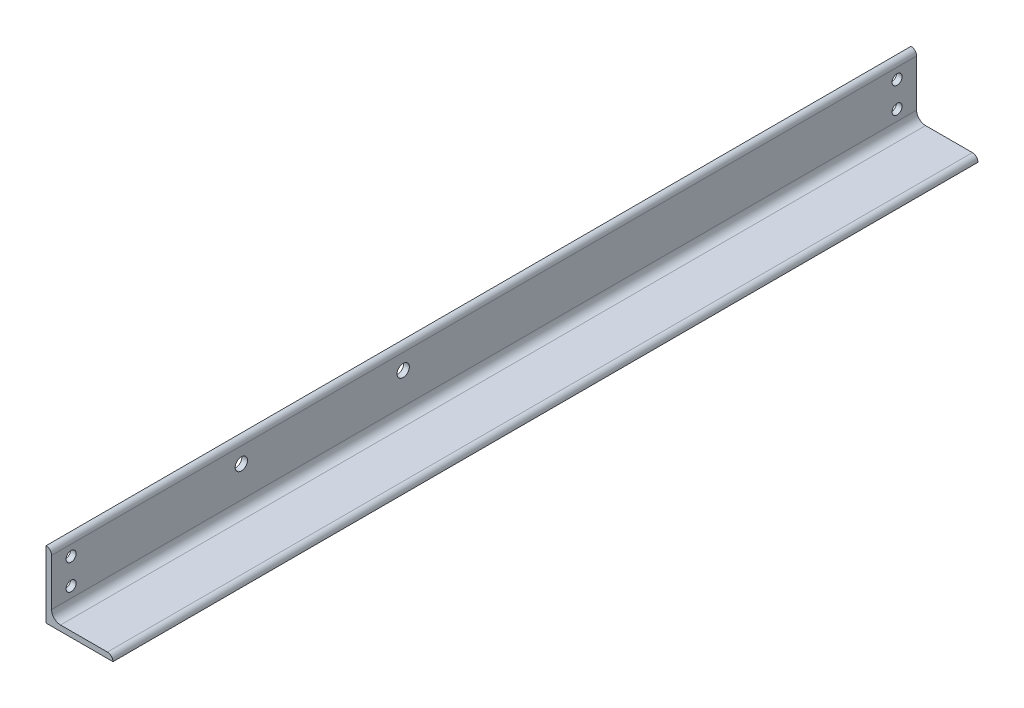
ISO-10303-21;
HEADER;
FILE_DESCRIPTION(('STEP AP214'),'2;1');
FILE_NAME('part.step','',(''),(''),'','','');
FILE_SCHEMA(('AUTOMOTIVE_DESIGN { 1 0 10303 214 1 1 1 1 }'));
ENDSEC;
DATA;
#1=APPLICATION_CONTEXT('core data for automotive mechanical design processes');
#2=APPLICATION_PROTOCOL_DEFINITION('international standard','automotive_design',2000,#1);
#3=PRODUCT_CONTEXT('',#1,'mechanical');
#4=PRODUCT('Part','Part','',(#3));
#5=PRODUCT_RELATED_PRODUCT_CATEGORY('part','',(#4));
#6=PRODUCT_DEFINITION_FORMATION('','',#4);
#7=PRODUCT_DEFINITION_CONTEXT('part definition',#1,'design');
#8=PRODUCT_DEFINITION('design','',#6,#7);
#9=PRODUCT_DEFINITION_SHAPE('','',#8);
#10=(LENGTH_UNIT() NAMED_UNIT(*) SI_UNIT(.MILLI.,.METRE.));
#11=(NAMED_UNIT(*) PLANE_ANGLE_UNIT() SI_UNIT($,.RADIAN.));
#12=(NAMED_UNIT(*) SI_UNIT($,.STERADIAN.) SOLID_ANGLE_UNIT());
#13=UNCERTAINTY_MEASURE_WITH_UNIT(LENGTH_MEASURE(1.E-05),#10,'distance_accuracy_value','');
#14=(GEOMETRIC_REPRESENTATION_CONTEXT(3) GLOBAL_UNCERTAINTY_ASSIGNED_CONTEXT((#13)) GLOBAL_UNIT_ASSIGNED_CONTEXT((#10,
#11,#12)) REPRESENTATION_CONTEXT('',''));
#15=CARTESIAN_POINT('',(0.,0.,0.));
#16=DIRECTION('',(0.,0.,1.));
#17=DIRECTION('',(1.,0.,0.));
#18=AXIS2_PLACEMENT_3D('',#15,#16,#17);
#19=CARTESIAN_POINT('',(59.9999999999999,1.66533453693773E-13,-387.5));
#20=DIRECTION('',(0.,1.,0.));
#21=DIRECTION('',(-1.,0.,0.));
#22=AXIS2_PLACEMENT_3D('',#19,#20,#21);
#23=PLANE('',#22);
#24=DIRECTION('',(1.,0.,0.));
#25=VECTOR('',#24,1.);
#26=CARTESIAN_POINT('',(59.9999999999999,1.66533453693773E-13,387.5));
#27=LINE('',#26,#25);
#28=CARTESIAN_POINT('',(0.,0.,387.5));
#29=VERTEX_POINT('',#28);
#30=CARTESIAN_POINT('',(59.9999999999999,1.66533453693773E-13,387.5));
#31=VERTEX_POINT('',#30);
#32=EDGE_CURVE('E129',#29,#31,#27,.T.);
#33=ORIENTED_EDGE('',*,*,#32,.F.);
#34=DIRECTION('',(0.,0.,1.));
#35=VECTOR('',#34,1.);
#36=CARTESIAN_POINT('',(0.,1.66533453693773E-13,-387.5));
#37=LINE('',#36,#35);
#38=CARTESIAN_POINT('',(0.,1.66533453693773E-13,-387.5));
#39=VERTEX_POINT('',#38);
#40=EDGE_CURVE('E111',#39,#29,#37,.T.);
#41=ORIENTED_EDGE('',*,*,#40,.F.);
#42=DIRECTION('',(1.,0.,0.));
#43=VECTOR('',#42,1.);
#44=CARTESIAN_POINT('',(59.9999999999999,1.66533453693773E-13,-387.5));
#45=LINE('',#44,#43);
#46=CARTESIAN_POINT('',(59.9999999999999,1.66533453693773E-13,-387.5));
#47=VERTEX_POINT('',#46);
#48=EDGE_CURVE('E96',#39,#47,#45,.T.);
#49=ORIENTED_EDGE('',*,*,#48,.T.);
#50=DIRECTION('',(0.,0.,1.));
#51=VECTOR('',#50,1.);
#52=CARTESIAN_POINT('',(59.9999999999999,1.66533453693773E-13,-387.5));
#53=LINE('',#52,#51);
#54=EDGE_CURVE('E103',#47,#31,#53,.T.);
#55=ORIENTED_EDGE('',*,*,#54,.T.);
#56=EDGE_LOOP('',(#33,#41,#49,#55));
#57=FACE_BOUND('',#56,.T.);
#58=ADVANCED_FACE('F37',(#57),#23,.F.);
#59=CARTESIAN_POINT('',(13.,5.00000000000017,-387.5));
#60=DIRECTION('',(0.,-1.,0.));
#61=DIRECTION('',(1.,0.,0.));
#62=AXIS2_PLACEMENT_3D('',#59,#60,#61);
#63=PLANE('',#62);
#64=DIRECTION('',(-1.,0.,0.));
#65=VECTOR('',#64,1.);
#66=CARTESIAN_POINT('',(13.,5.00000000000017,-387.5));
#67=LINE('',#66,#65);
#68=CARTESIAN_POINT('',(55.,5.00000000000017,-387.5));
#69=VERTEX_POINT('',#68);
#70=CARTESIAN_POINT('',(13.,5.00000000000017,-387.5));
#71=VERTEX_POINT('',#70);
#72=EDGE_CURVE('E99',#69,#71,#67,.T.);
#73=ORIENTED_EDGE('',*,*,#72,.T.);
#74=DIRECTION('',(0.,0.,1.));
#75=VECTOR('',#74,1.);
#76=CARTESIAN_POINT('',(13.,5.00000000000017,-387.5));
#77=LINE('',#76,#75);
#78=CARTESIAN_POINT('',(13.,5.,387.5));
#79=VERTEX_POINT('',#78);
#80=EDGE_CURVE('E108',#71,#79,#77,.T.);
#81=ORIENTED_EDGE('',*,*,#80,.T.);
#82=DIRECTION('',(-1.,0.,0.));
#83=VECTOR('',#82,1.);
#84=CARTESIAN_POINT('',(13.,5.,387.5));
#85=LINE('',#84,#83);
#86=CARTESIAN_POINT('',(55.,5.00000000000017,387.5));
#87=VERTEX_POINT('',#86);
#88=EDGE_CURVE('E131',#87,#79,#85,.T.);
#89=ORIENTED_EDGE('',*,*,#88,.F.);
#90=DIRECTION('',(0.,0.,1.));
#91=VECTOR('',#90,1.);
#92=CARTESIAN_POINT('',(55.,5.00000000000017,-387.5));
#93=LINE('',#92,#91);
#94=EDGE_CURVE('E11',#69,#87,#93,.T.);
#95=ORIENTED_EDGE('',*,*,#94,.F.);
#96=EDGE_LOOP('',(#73,#81,#89,#95));
#97=FACE_BOUND('',#96,.T.);
#98=ADVANCED_FACE('F168',(#97),#63,.F.);
#99=CARTESIAN_POINT('',(13.,13.0000000000002,-387.5));
#100=DIRECTION('',(0.,0.,1.));
#101=DIRECTION('',(-1.,0.,0.));
#102=AXIS2_PLACEMENT_3D('',#99,#100,#101);
#103=CYLINDRICAL_SURFACE('',#102,8.);
#104=CARTESIAN_POINT('',(13.,13.,387.5));
#105=DIRECTION('',(0.,0.,-1.));
#106=DIRECTION('',(-1.,0.,0.));
#107=AXIS2_PLACEMENT_3D('',#104,#105,#106);
#108=CIRCLE('',#107,8.);
#109=CARTESIAN_POINT('',(5.,13.,387.5));
#110=VERTEX_POINT('',#109);
#111=EDGE_CURVE('E134',#79,#110,#108,.T.);
#112=ORIENTED_EDGE('',*,*,#111,.F.);
#113=ORIENTED_EDGE('',*,*,#80,.F.);
#114=CARTESIAN_POINT('',(13.,13.0000000000002,-387.5));
#115=DIRECTION('',(0.,0.,-1.));
#116=DIRECTION('',(-1.,0.,0.));
#117=AXIS2_PLACEMENT_3D('',#114,#115,#116);
#118=CIRCLE('',#117,8.);
#119=CARTESIAN_POINT('',(5.,13.0000000000002,-387.5));
#120=VERTEX_POINT('',#119);
#121=EDGE_CURVE('E114',#71,#120,#118,.T.);
#122=ORIENTED_EDGE('',*,*,#121,.T.);
#123=DIRECTION('',(0.,0.,1.));
#124=VECTOR('',#123,1.);
#125=CARTESIAN_POINT('',(5.,13.0000000000002,-387.5));
#126=LINE('',#125,#124);
#127=EDGE_CURVE('E143',#120,#110,#126,.T.);
#128=ORIENTED_EDGE('',*,*,#127,.T.);
#129=EDGE_LOOP('',(#112,#113,#122,#128));
#130=FACE_BOUND('',#129,.T.);
#131=ADVANCED_FACE('F165',(#130),#103,.F.);
#132=CARTESIAN_POINT('',(5.,60.0000000000001,-387.5));
#133=DIRECTION('',(-1.,0.,0.));
#134=DIRECTION('',(0.,-1.,0.));
#135=AXIS2_PLACEMENT_3D('',#132,#133,#134);
#136=PLANE('',#135);
#137=CARTESIAN_POINT('',(5.,22.5,-370.));
#138=DIRECTION('',(-1.,0.,0.));
#139=DIRECTION('',(0.,0.,1.));
#140=AXIS2_PLACEMENT_3D('',#137,#138,#139);
#141=CIRCLE('',#140,4.5);
#142=CARTESIAN_POINT('',(5.,22.5,-365.5));
#143=VERTEX_POINT('',#142);
#144=EDGE_CURVE('E200',#143,#143,#141,.T.);
#145=ORIENTED_EDGE('',*,*,#144,.T.);
#146=EDGE_LOOP('',(#145));
#147=FACE_BOUND('',#146,.T.);
#148=CARTESIAN_POINT('',(5.,45.5000000000001,-370.));
#149=DIRECTION('',(-1.,0.,0.));
#150=DIRECTION('',(0.,0.,1.));
#151=AXIS2_PLACEMENT_3D('',#148,#149,#150);
#152=CIRCLE('',#151,4.5);
#153=CARTESIAN_POINT('',(5.,45.5000000000001,-365.5));
#154=VERTEX_POINT('',#153);
#155=EDGE_CURVE('E204',#154,#154,#152,.T.);
#156=ORIENTED_EDGE('',*,*,#155,.T.);
#157=EDGE_LOOP('',(#156));
#158=FACE_BOUND('',#157,.T.);
#159=CARTESIAN_POINT('',(5.,22.5,370.));
#160=DIRECTION('',(-1.,0.,0.));
#161=DIRECTION('',(0.,0.,1.));
#162=AXIS2_PLACEMENT_3D('',#159,#160,#161);
#163=CIRCLE('',#162,4.5);
#164=CARTESIAN_POINT('',(5.,22.5,374.5));
#165=VERTEX_POINT('',#164);
#166=EDGE_CURVE('E208',#165,#165,#163,.T.);
#167=ORIENTED_EDGE('',*,*,#166,.T.);
#168=EDGE_LOOP('',(#167));
#169=FACE_BOUND('',#168,.T.);
#170=CARTESIAN_POINT('',(5.,45.5000000000001,370.));
#171=DIRECTION('',(-1.,0.,0.));
#172=DIRECTION('',(0.,0.,1.));
#173=AXIS2_PLACEMENT_3D('',#170,#171,#172);
#174=CIRCLE('',#173,4.5);
#175=CARTESIAN_POINT('',(5.,45.5000000000001,374.5));
#176=VERTEX_POINT('',#175);
#177=EDGE_CURVE('E212',#176,#176,#174,.T.);
#178=ORIENTED_EDGE('',*,*,#177,.T.);
#179=EDGE_LOOP('',(#178));
#180=FACE_BOUND('',#179,.T.);
#181=CARTESIAN_POINT('',(5.,41.0000000000001,72.4999999999995));
#182=DIRECTION('',(-1.,0.,0.));
#183=DIRECTION('',(0.,0.,1.));
#184=AXIS2_PLACEMENT_3D('',#181,#182,#183);
#185=CIRCLE('',#184,5.5);
#186=CARTESIAN_POINT('',(5.,41.0000000000001,77.9999999999995));
#187=VERTEX_POINT('',#186);
#188=EDGE_CURVE('E216',#187,#187,#185,.T.);
#189=ORIENTED_EDGE('',*,*,#188,.T.);
#190=EDGE_LOOP('',(#189));
#191=FACE_BOUND('',#190,.T.);
#192=CARTESIAN_POINT('',(5.,41.0000000000002,217.499999999999));
#193=DIRECTION('',(-1.,0.,0.));
#194=DIRECTION('',(0.,0.,1.));
#195=AXIS2_PLACEMENT_3D('',#192,#193,#194);
#196=CIRCLE('',#195,5.5);
#197=CARTESIAN_POINT('',(5.,41.0000000000002,222.999999999999));
#198=VERTEX_POINT('',#197);
#199=EDGE_CURVE('E219',#198,#198,#196,.T.);
#200=ORIENTED_EDGE('',*,*,#199,.T.);
#201=EDGE_LOOP('',(#200));
#202=FACE_BOUND('',#201,.T.);
#203=DIRECTION('',(0.,1.,0.));
#204=VECTOR('',#203,1.);
#205=CARTESIAN_POINT('',(5.,60.0000000000001,387.5));
#206=LINE('',#205,#204);
#207=CARTESIAN_POINT('',(5.,55.0000000000001,387.5));
#208=VERTEX_POINT('',#207);
#209=EDGE_CURVE('E116',#110,#208,#206,.T.);
#210=ORIENTED_EDGE('',*,*,#209,.F.);
#211=ORIENTED_EDGE('',*,*,#127,.F.);
#212=DIRECTION('',(0.,1.,0.));
#213=VECTOR('',#212,1.);
#214=CARTESIAN_POINT('',(5.,60.0000000000001,-387.5));
#215=LINE('',#214,#213);
#216=CARTESIAN_POINT('',(5.,55.0000000000001,-387.5));
#217=VERTEX_POINT('',#216);
#218=EDGE_CURVE('E124',#120,#217,#215,.T.);
#219=ORIENTED_EDGE('',*,*,#218,.T.);
#220=DIRECTION('',(0.,0.,1.));
#221=VECTOR('',#220,1.);
#222=CARTESIAN_POINT('',(5.,55.0000000000001,-387.5));
#223=LINE('',#222,#221);
#224=EDGE_CURVE('E100',#208,#217,#223,.F.);
#225=ORIENTED_EDGE('',*,*,#224,.F.);
#226=EDGE_LOOP('',(#210,#211,#219,#225));
#227=FACE_BOUND('',#226,.T.);
#228=ADVANCED_FACE('F161',(#147,#158,#169,#180,#191,#202,#227),#136,.F.);
#229=CARTESIAN_POINT('',(0.,60.0000000000001,-387.5));
#230=DIRECTION('',(1.,0.,0.));
#231=DIRECTION('',(0.,1.,0.));
#232=AXIS2_PLACEMENT_3D('',#229,#230,#231);
#233=PLANE('',#232);
#234=CARTESIAN_POINT('',(0.,22.5000000000002,-370.));
#235=DIRECTION('',(-1.,0.,0.));
#236=DIRECTION('',(0.,0.,1.));
#237=AXIS2_PLACEMENT_3D('',#234,#235,#236);
#238=CIRCLE('',#237,4.5);
#239=CARTESIAN_POINT('',(0.,22.5000000000002,-365.5));
#240=VERTEX_POINT('',#239);
#241=EDGE_CURVE('E239',#240,#240,#238,.T.);
#242=ORIENTED_EDGE('',*,*,#241,.F.);
#243=EDGE_LOOP('',(#242));
#244=FACE_BOUND('',#243,.T.);
#245=CARTESIAN_POINT('',(0.,45.5000000000001,-370.));
#246=DIRECTION('',(-1.,0.,0.));
#247=DIRECTION('',(0.,0.,1.));
#248=AXIS2_PLACEMENT_3D('',#245,#246,#247);
#249=CIRCLE('',#248,4.5);
#250=CARTESIAN_POINT('',(0.,45.5000000000001,-365.5));
#251=VERTEX_POINT('',#250);
#252=EDGE_CURVE('E235',#251,#251,#249,.T.);
#253=ORIENTED_EDGE('',*,*,#252,.F.);
#254=EDGE_LOOP('',(#253));
#255=FACE_BOUND('',#254,.T.);
#256=CARTESIAN_POINT('',(0.,22.5,370.));
#257=DIRECTION('',(-1.,0.,0.));
#258=DIRECTION('',(0.,0.,1.));
#259=AXIS2_PLACEMENT_3D('',#256,#257,#258);
#260=CIRCLE('',#259,4.5);
#261=CARTESIAN_POINT('',(0.,22.5,374.5));
#262=VERTEX_POINT('',#261);
#263=EDGE_CURVE('E231',#262,#262,#260,.T.);
#264=ORIENTED_EDGE('',*,*,#263,.F.);
#265=EDGE_LOOP('',(#264));
#266=FACE_BOUND('',#265,.T.);
#267=CARTESIAN_POINT('',(0.,45.5000000000001,370.));
#268=DIRECTION('',(-1.,0.,0.));
#269=DIRECTION('',(0.,0.,1.));
#270=AXIS2_PLACEMENT_3D('',#267,#268,#269);
#271=CIRCLE('',#270,4.5);
#272=CARTESIAN_POINT('',(0.,45.5000000000001,374.5));
#273=VERTEX_POINT('',#272);
#274=EDGE_CURVE('E227',#273,#273,#271,.T.);
#275=ORIENTED_EDGE('',*,*,#274,.F.);
#276=EDGE_LOOP('',(#275));
#277=FACE_BOUND('',#276,.T.);
#278=CARTESIAN_POINT('',(0.,41.0000000000001,72.4999999999995));
#279=DIRECTION('',(-1.,0.,0.));
#280=DIRECTION('',(0.,0.,1.));
#281=AXIS2_PLACEMENT_3D('',#278,#279,#280);
#282=CIRCLE('',#281,5.5);
#283=CARTESIAN_POINT('',(0.,41.0000000000001,77.9999999999995));
#284=VERTEX_POINT('',#283);
#285=EDGE_CURVE('E221',#284,#284,#282,.T.);
#286=ORIENTED_EDGE('',*,*,#285,.F.);
#287=EDGE_LOOP('',(#286));
#288=FACE_BOUND('',#287,.T.);
#289=CARTESIAN_POINT('',(0.,41.0000000000002,217.499999999999));
#290=DIRECTION('',(-1.,0.,0.));
#291=DIRECTION('',(0.,0.,1.));
#292=AXIS2_PLACEMENT_3D('',#289,#290,#291);
#293=CIRCLE('',#292,5.5);
#294=CARTESIAN_POINT('',(0.,41.0000000000002,222.999999999999));
#295=VERTEX_POINT('',#294);
#296=EDGE_CURVE('E119',#295,#295,#293,.T.);
#297=ORIENTED_EDGE('',*,*,#296,.F.);
#298=EDGE_LOOP('',(#297));
#299=FACE_BOUND('',#298,.T.);
#300=DIRECTION('',(0.,-1.,0.));
#301=VECTOR('',#300,1.);
#302=CARTESIAN_POINT('',(0.,60.0000000000001,387.5));
#303=LINE('',#302,#301);
#304=CARTESIAN_POINT('',(0.,60.0000000000001,387.5));
#305=VERTEX_POINT('',#304);
#306=EDGE_CURVE('E112',#305,#29,#303,.T.);
#307=ORIENTED_EDGE('',*,*,#306,.F.);
#308=DIRECTION('',(0.,0.,1.));
#309=VECTOR('',#308,1.);
#310=CARTESIAN_POINT('',(0.,60.0000000000001,-387.5));
#311=LINE('',#310,#309);
#312=CARTESIAN_POINT('',(0.,60.0000000000001,-387.5));
#313=VERTEX_POINT('',#312);
#314=EDGE_CURVE('E140',#313,#305,#311,.T.);
#315=ORIENTED_EDGE('',*,*,#314,.F.);
#316=DIRECTION('',(0.,-1.,0.));
#317=VECTOR('',#316,1.);
#318=CARTESIAN_POINT('',(0.,60.0000000000001,-387.5));
#319=LINE('',#318,#317);
#320=EDGE_CURVE('E127',#313,#39,#319,.T.);
#321=ORIENTED_EDGE('',*,*,#320,.T.);
#322=ORIENTED_EDGE('',*,*,#40,.T.);
#323=EDGE_LOOP('',(#307,#315,#321,#322));
#324=FACE_BOUND('',#323,.T.);
#325=ADVANCED_FACE('F157',(#244,#255,#266,#277,#288,#299,#324),#233,.F.);
#326=CARTESIAN_POINT('',(13.,13.0000000000002,-387.5));
#327=DIRECTION('',(0.,0.,1.));
#328=DIRECTION('',(-1.,0.,0.));
#329=AXIS2_PLACEMENT_3D('',#326,#327,#328);
#330=PLANE('',#329);
#331=ORIENTED_EDGE('',*,*,#218,.F.);
#332=ORIENTED_EDGE('',*,*,#121,.F.);
#333=ORIENTED_EDGE('',*,*,#72,.F.);
#334=CARTESIAN_POINT('',(55.,1.66533453693773E-13,-387.5));
#335=DIRECTION('',(0.,0.,-1.));
#336=DIRECTION('',(-1.,0.,0.));
#337=AXIS2_PLACEMENT_3D('',#334,#335,#336);
#338=CIRCLE('',#337,5.);
#339=EDGE_CURVE('E51',#47,#69,#338,.F.);
#340=ORIENTED_EDGE('',*,*,#339,.F.);
#341=ORIENTED_EDGE('',*,*,#48,.F.);
#342=ORIENTED_EDGE('',*,*,#320,.F.);
#343=CARTESIAN_POINT('',(0.,55.0000000000001,-387.5));
#344=DIRECTION('',(0.,0.,-1.));
#345=DIRECTION('',(-1.,0.,0.));
#346=AXIS2_PLACEMENT_3D('',#343,#344,#345);
#347=CIRCLE('',#346,5.);
#348=EDGE_CURVE('E45',#217,#313,#347,.F.);
#349=ORIENTED_EDGE('',*,*,#348,.F.);
#350=EDGE_LOOP('',(#331,#332,#333,#340,#341,#342,#349));
#351=FACE_BOUND('',#350,.T.);
#352=ADVANCED_FACE('F94',(#351),#330,.F.);
#353=CARTESIAN_POINT('',(13.,13.,387.5));
#354=DIRECTION('',(0.,0.,1.));
#355=DIRECTION('',(-1.,0.,0.));
#356=AXIS2_PLACEMENT_3D('',#353,#354,#355);
#357=PLANE('',#356);
#358=ORIENTED_EDGE('',*,*,#306,.T.);
#359=ORIENTED_EDGE('',*,*,#32,.T.);
#360=CARTESIAN_POINT('',(55.,1.66533453693773E-13,387.5));
#361=DIRECTION('',(0.,0.,-1.));
#362=DIRECTION('',(-1.,0.,0.));
#363=AXIS2_PLACEMENT_3D('',#360,#361,#362);
#364=CIRCLE('',#363,5.);
#365=EDGE_CURVE('E104',#87,#31,#364,.T.);
#366=ORIENTED_EDGE('',*,*,#365,.F.);
#367=ORIENTED_EDGE('',*,*,#88,.T.);
#368=ORIENTED_EDGE('',*,*,#111,.T.);
#369=ORIENTED_EDGE('',*,*,#209,.T.);
#370=CARTESIAN_POINT('',(0.,55.0000000000001,387.5));
#371=DIRECTION('',(0.,0.,-1.));
#372=DIRECTION('',(-1.,0.,0.));
#373=AXIS2_PLACEMENT_3D('',#370,#371,#372);
#374=CIRCLE('',#373,5.);
#375=EDGE_CURVE('E149',#305,#208,#374,.T.);
#376=ORIENTED_EDGE('',*,*,#375,.F.);
#377=EDGE_LOOP('',(#358,#359,#366,#367,#368,#369,#376));
#378=FACE_BOUND('',#377,.T.);
#379=ADVANCED_FACE('F159',(#378),#357,.T.);
#380=CARTESIAN_POINT('',(0.,55.0000000000001,-387.5));
#381=DIRECTION('',(0.,0.,1.));
#382=DIRECTION('',(-1.,0.,0.));
#383=AXIS2_PLACEMENT_3D('',#380,#381,#382);
#384=CYLINDRICAL_SURFACE('',#383,5.);
#385=ORIENTED_EDGE('',*,*,#348,.T.);
#386=ORIENTED_EDGE('',*,*,#314,.T.);
#387=ORIENTED_EDGE('',*,*,#375,.T.);
#388=ORIENTED_EDGE('',*,*,#224,.T.);
#389=EDGE_LOOP('',(#385,#386,#387,#388));
#390=FACE_BOUND('',#389,.T.);
#391=ADVANCED_FACE('F152',(#390),#384,.T.);
#392=CARTESIAN_POINT('',(55.,1.66533453693773E-13,-387.5));
#393=DIRECTION('',(0.,0.,1.));
#394=DIRECTION('',(-1.,0.,0.));
#395=AXIS2_PLACEMENT_3D('',#392,#393,#394);
#396=CYLINDRICAL_SURFACE('',#395,5.);
#397=ORIENTED_EDGE('',*,*,#339,.T.);
#398=ORIENTED_EDGE('',*,*,#94,.T.);
#399=ORIENTED_EDGE('',*,*,#365,.T.);
#400=ORIENTED_EDGE('',*,*,#54,.F.);
#401=EDGE_LOOP('',(#397,#398,#399,#400));
#402=FACE_BOUND('',#401,.T.);
#403=ADVANCED_FACE('F39',(#402),#396,.T.);
#404=CARTESIAN_POINT('',(5.,41.0000000000002,217.499999999999));
#405=DIRECTION('',(1.,0.,0.));
#406=DIRECTION('',(0.,0.,1.));
#407=AXIS2_PLACEMENT_3D('',#404,#405,#406);
#408=CYLINDRICAL_SURFACE('',#407,5.5);
#409=ORIENTED_EDGE('',*,*,#296,.T.);
#410=EDGE_LOOP('',(#409));
#411=FACE_BOUND('',#410,.T.);
#412=ORIENTED_EDGE('',*,*,#199,.F.);
#413=EDGE_LOOP('',(#412));
#414=FACE_BOUND('',#413,.T.);
#415=ADVANCED_FACE('F183',(#411,#414),#408,.F.);
#416=CARTESIAN_POINT('',(5.,41.0000000000001,72.4999999999995));
#417=DIRECTION('',(1.,0.,0.));
#418=DIRECTION('',(0.,0.,1.));
#419=AXIS2_PLACEMENT_3D('',#416,#417,#418);
#420=CYLINDRICAL_SURFACE('',#419,5.5);
#421=ORIENTED_EDGE('',*,*,#285,.T.);
#422=EDGE_LOOP('',(#421));
#423=FACE_BOUND('',#422,.T.);
#424=ORIENTED_EDGE('',*,*,#188,.F.);
#425=EDGE_LOOP('',(#424));
#426=FACE_BOUND('',#425,.T.);
#427=ADVANCED_FACE('F258',(#423,#426),#420,.F.);
#428=CARTESIAN_POINT('',(5.,45.5000000000001,370.));
#429=DIRECTION('',(1.,0.,0.));
#430=DIRECTION('',(0.,0.,1.));
#431=AXIS2_PLACEMENT_3D('',#428,#429,#430);
#432=CYLINDRICAL_SURFACE('',#431,4.5);
#433=ORIENTED_EDGE('',*,*,#274,.T.);
#434=EDGE_LOOP('',(#433));
#435=FACE_BOUND('',#434,.T.);
#436=ORIENTED_EDGE('',*,*,#177,.F.);
#437=EDGE_LOOP('',(#436));
#438=FACE_BOUND('',#437,.T.);
#439=ADVANCED_FACE('F262',(#435,#438),#432,.F.);
#440=CARTESIAN_POINT('',(5.,22.5,370.));
#441=DIRECTION('',(1.,0.,0.));
#442=DIRECTION('',(0.,0.,1.));
#443=AXIS2_PLACEMENT_3D('',#440,#441,#442);
#444=CYLINDRICAL_SURFACE('',#443,4.5);
#445=ORIENTED_EDGE('',*,*,#263,.T.);
#446=EDGE_LOOP('',(#445));
#447=FACE_BOUND('',#446,.T.);
#448=ORIENTED_EDGE('',*,*,#166,.F.);
#449=EDGE_LOOP('',(#448));
#450=FACE_BOUND('',#449,.T.);
#451=ADVANCED_FACE('F268',(#447,#450),#444,.F.);
#452=CARTESIAN_POINT('',(5.,45.5000000000001,-370.));
#453=DIRECTION('',(1.,0.,0.));
#454=DIRECTION('',(0.,0.,1.));
#455=AXIS2_PLACEMENT_3D('',#452,#453,#454);
#456=CYLINDRICAL_SURFACE('',#455,4.5);
#457=ORIENTED_EDGE('',*,*,#252,.T.);
#458=EDGE_LOOP('',(#457));
#459=FACE_BOUND('',#458,.T.);
#460=ORIENTED_EDGE('',*,*,#155,.F.);
#461=EDGE_LOOP('',(#460));
#462=FACE_BOUND('',#461,.T.);
#463=ADVANCED_FACE('F272',(#459,#462),#456,.F.);
#464=CARTESIAN_POINT('',(5.,22.5,-370.));
#465=DIRECTION('',(1.,0.,0.));
#466=DIRECTION('',(0.,0.,1.));
#467=AXIS2_PLACEMENT_3D('',#464,#465,#466);
#468=CYLINDRICAL_SURFACE('',#467,4.5);
#469=ORIENTED_EDGE('',*,*,#241,.T.);
#470=EDGE_LOOP('',(#469));
#471=FACE_BOUND('',#470,.T.);
#472=ORIENTED_EDGE('',*,*,#144,.F.);
#473=EDGE_LOOP('',(#472));
#474=FACE_BOUND('',#473,.T.);
#475=ADVANCED_FACE('F244',(#471,#474),#468,.F.);
#476=CLOSED_SHELL('',(#58,#98,#131,#228,#325,#352,#379,#391,#403,#415,#427,#439,#451,#463,#475));
#477=MANIFOLD_SOLID_BREP('B2',#476);
#478=ADVANCED_BREP_SHAPE_REPRESENTATION('',(#18,#477),#14);
#479=SHAPE_DEFINITION_REPRESENTATION(#9,#478);
ENDSEC;
END-ISO-10303-21;
